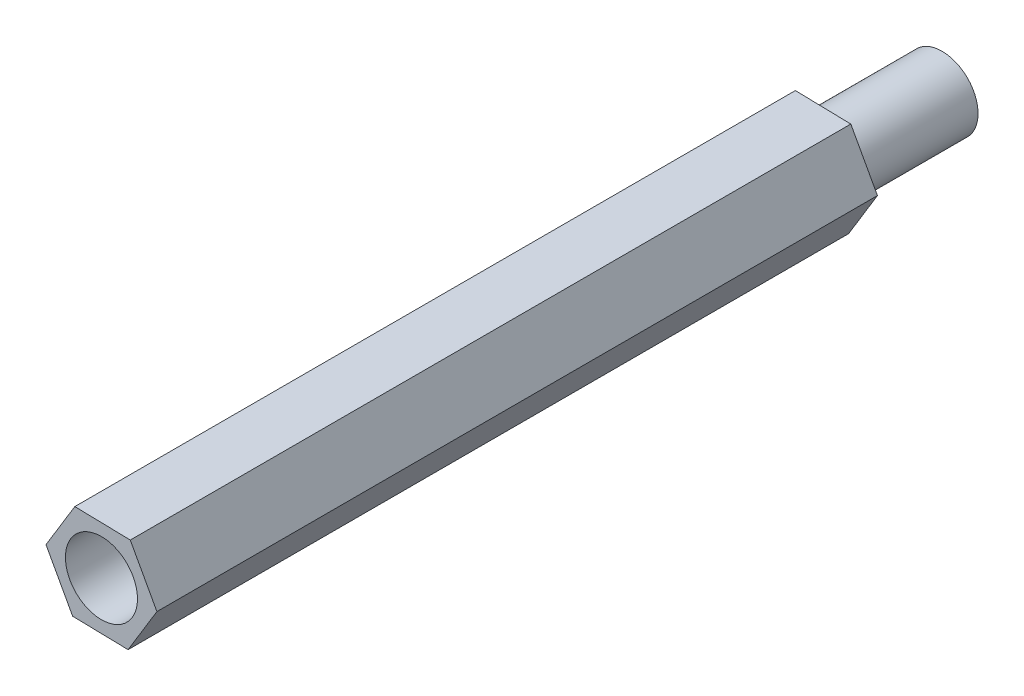
ISO-10303-21;
HEADER;
FILE_DESCRIPTION(('STEP AP214'),'2;1');
FILE_NAME('part.step','',(''),(''),'','','');
FILE_SCHEMA(('AUTOMOTIVE_DESIGN { 1 0 10303 214 1 1 1 1 }'));
ENDSEC;
DATA;
#1=APPLICATION_CONTEXT('core data for automotive mechanical design processes');
#2=APPLICATION_PROTOCOL_DEFINITION('international standard','automotive_design',2000,#1);
#3=PRODUCT_CONTEXT('',#1,'mechanical');
#4=PRODUCT('Part','Part','',(#3));
#5=PRODUCT_RELATED_PRODUCT_CATEGORY('part','',(#4));
#6=PRODUCT_DEFINITION_FORMATION('','',#4);
#7=PRODUCT_DEFINITION_CONTEXT('part definition',#1,'design');
#8=PRODUCT_DEFINITION('design','',#6,#7);
#9=PRODUCT_DEFINITION_SHAPE('','',#8);
#10=(LENGTH_UNIT() NAMED_UNIT(*) SI_UNIT(.MILLI.,.METRE.));
#11=(NAMED_UNIT(*) PLANE_ANGLE_UNIT() SI_UNIT($,.RADIAN.));
#12=(NAMED_UNIT(*) SI_UNIT($,.STERADIAN.) SOLID_ANGLE_UNIT());
#13=UNCERTAINTY_MEASURE_WITH_UNIT(LENGTH_MEASURE(1.E-05),#10,'distance_accuracy_value','');
#14=(GEOMETRIC_REPRESENTATION_CONTEXT(3) GLOBAL_UNCERTAINTY_ASSIGNED_CONTEXT((#13)) GLOBAL_UNIT_ASSIGNED_CONTEXT((#10,
#11,#12)) REPRESENTATION_CONTEXT('',''));
#15=CARTESIAN_POINT('',(0.,0.,0.));
#16=DIRECTION('',(0.,0.,1.));
#17=DIRECTION('',(1.,0.,0.));
#18=AXIS2_PLACEMENT_3D('',#15,#16,#17);
#19=CARTESIAN_POINT('',(-1.19995348671324,-1.97318143186532,30.));
#20=DIRECTION('',(0.0227762459496867,0.999740587662839,0.));
#21=DIRECTION('',(-0.999740587662839,0.0227762459496867,0.));
#22=AXIS2_PLACEMENT_3D('',#19,#20,#21);
#23=PLANE('',#22);
#24=DIRECTION('',(0.999740587662839,-0.0227762459496867,0.));
#25=VECTOR('',#24,1.);
#26=CARTESIAN_POINT('',(-1.19995348671324,-1.97318143186532,0.));
#27=LINE('',#26,#25);
#28=CARTESIAN_POINT('',(-1.19995348671324,-1.97318143186532,0.));
#29=VERTEX_POINT('',#28);
#30=CARTESIAN_POINT('',(1.1088485029145,-2.02578091878604,0.));
#31=VERTEX_POINT('',#30);
#32=EDGE_CURVE('E134',#29,#31,#27,.T.);
#33=ORIENTED_EDGE('',*,*,#32,.T.);
#34=DIRECTION('',(0.,0.,-1.));
#35=VECTOR('',#34,1.);
#36=CARTESIAN_POINT('',(1.1088485029145,-2.02578091878604,30.));
#37=LINE('',#36,#35);
#38=CARTESIAN_POINT('',(1.1088485029145,-2.02578091878604,30.));
#39=VERTEX_POINT('',#38);
#40=EDGE_CURVE('E46',#39,#31,#37,.T.);
#41=ORIENTED_EDGE('',*,*,#40,.F.);
#42=DIRECTION('',(0.999740587662839,-0.0227762459496867,0.));
#43=VECTOR('',#42,1.);
#44=CARTESIAN_POINT('',(-1.19995348671324,-1.97318143186532,30.));
#45=LINE('',#44,#43);
#46=CARTESIAN_POINT('',(-1.19995348671324,-1.97318143186532,30.));
#47=VERTEX_POINT('',#46);
#48=EDGE_CURVE('E151',#47,#39,#45,.T.);
#49=ORIENTED_EDGE('',*,*,#48,.F.);
#50=DIRECTION('',(0.,0.,-1.));
#51=VECTOR('',#50,1.);
#52=CARTESIAN_POINT('',(-1.19995348671324,-1.97318143186532,30.));
#53=LINE('',#52,#51);
#54=EDGE_CURVE('E130',#47,#29,#53,.T.);
#55=ORIENTED_EDGE('',*,*,#54,.T.);
#56=EDGE_LOOP('',(#33,#41,#49,#55));
#57=FACE_BOUND('',#56,.T.);
#58=ADVANCED_FACE('F43',(#57),#23,.F.);
#59=CARTESIAN_POINT('',(1.1088485029145,-2.02578091878604,30.));
#60=DIRECTION('',(-0.854412623135559,0.519595101426691,0.));
#61=DIRECTION('',(-0.519595101426691,-0.854412623135559,0.));
#62=AXIS2_PLACEMENT_3D('',#59,#60,#61);
#63=PLANE('',#62);
#64=DIRECTION('',(0.519595101426691,0.854412623135559,0.));
#65=VECTOR('',#64,1.);
#66=CARTESIAN_POINT('',(1.1088485029145,-2.02578091878604,0.));
#67=LINE('',#66,#65);
#68=CARTESIAN_POINT('',(2.30880198962774,-0.0525994869207228,0.));
#69=VERTEX_POINT('',#68);
#70=EDGE_CURVE('E138',#31,#69,#67,.T.);
#71=ORIENTED_EDGE('',*,*,#70,.T.);
#72=DIRECTION('',(0.,0.,-1.));
#73=VECTOR('',#72,1.);
#74=CARTESIAN_POINT('',(2.30880198962774,-0.0525994869207228,30.));
#75=LINE('',#74,#73);
#76=CARTESIAN_POINT('',(2.30880198962774,-0.0525994869207228,30.));
#77=VERTEX_POINT('',#76);
#78=EDGE_CURVE('E157',#77,#69,#75,.T.);
#79=ORIENTED_EDGE('',*,*,#78,.F.);
#80=DIRECTION('',(0.519595101426691,0.854412623135559,0.));
#81=VECTOR('',#80,1.);
#82=CARTESIAN_POINT('',(1.1088485029145,-2.02578091878604,30.));
#83=LINE('',#82,#81);
#84=EDGE_CURVE('E99',#39,#77,#83,.T.);
#85=ORIENTED_EDGE('',*,*,#84,.F.);
#86=ORIENTED_EDGE('',*,*,#40,.T.);
#87=EDGE_LOOP('',(#71,#79,#85,#86));
#88=FACE_BOUND('',#87,.T.);
#89=ADVANCED_FACE('F164',(#88),#63,.F.);
#90=CARTESIAN_POINT('',(2.30880198962774,-0.0525994869207228,30.));
#91=DIRECTION('',(-0.877188869085246,-0.480145486236149,0.));
#92=DIRECTION('',(0.480145486236149,-0.877188869085246,0.));
#93=AXIS2_PLACEMENT_3D('',#90,#91,#92);
#94=PLANE('',#93);
#95=DIRECTION('',(-0.480145486236149,0.877188869085246,0.));
#96=VECTOR('',#95,1.);
#97=CARTESIAN_POINT('',(2.30880198962774,-0.0525994869207228,0.));
#98=LINE('',#97,#96);
#99=CARTESIAN_POINT('',(1.19995348671324,1.97318143186532,0.));
#100=VERTEX_POINT('',#99);
#101=EDGE_CURVE('E142',#69,#100,#98,.T.);
#102=ORIENTED_EDGE('',*,*,#101,.T.);
#103=DIRECTION('',(0.,0.,-1.));
#104=VECTOR('',#103,1.);
#105=CARTESIAN_POINT('',(1.19995348671324,1.97318143186532,30.));
#106=LINE('',#105,#104);
#107=CARTESIAN_POINT('',(1.19995348671324,1.97318143186532,30.));
#108=VERTEX_POINT('',#107);
#109=EDGE_CURVE('E123',#108,#100,#106,.T.);
#110=ORIENTED_EDGE('',*,*,#109,.F.);
#111=DIRECTION('',(-0.480145486236149,0.877188869085246,0.));
#112=VECTOR('',#111,1.);
#113=CARTESIAN_POINT('',(2.30880198962774,-0.0525994869207228,30.));
#114=LINE('',#113,#112);
#115=EDGE_CURVE('E112',#77,#108,#114,.T.);
#116=ORIENTED_EDGE('',*,*,#115,.F.);
#117=ORIENTED_EDGE('',*,*,#78,.T.);
#118=EDGE_LOOP('',(#102,#110,#116,#117));
#119=FACE_BOUND('',#118,.T.);
#120=ADVANCED_FACE('F170',(#119),#94,.F.);
#121=CARTESIAN_POINT('',(1.19995348671324,1.97318143186532,30.));
#122=DIRECTION('',(-0.0227762459496867,-0.999740587662839,0.));
#123=DIRECTION('',(0.999740587662839,-0.0227762459496867,0.));
#124=AXIS2_PLACEMENT_3D('',#121,#122,#123);
#125=PLANE('',#124);
#126=DIRECTION('',(-0.999740587662839,0.0227762459496867,0.));
#127=VECTOR('',#126,1.);
#128=CARTESIAN_POINT('',(1.19995348671324,1.97318143186532,0.));
#129=LINE('',#128,#127);
#130=CARTESIAN_POINT('',(-1.1088485029145,2.02578091878604,0.));
#131=VERTEX_POINT('',#130);
#132=EDGE_CURVE('E121',#100,#131,#129,.T.);
#133=ORIENTED_EDGE('',*,*,#132,.T.);
#134=DIRECTION('',(0.,0.,-1.));
#135=VECTOR('',#134,1.);
#136=CARTESIAN_POINT('',(-1.1088485029145,2.02578091878604,30.));
#137=LINE('',#136,#135);
#138=CARTESIAN_POINT('',(-1.1088485029145,2.02578091878604,30.));
#139=VERTEX_POINT('',#138);
#140=EDGE_CURVE('E118',#139,#131,#137,.T.);
#141=ORIENTED_EDGE('',*,*,#140,.F.);
#142=DIRECTION('',(-0.999740587662839,0.0227762459496867,0.));
#143=VECTOR('',#142,1.);
#144=CARTESIAN_POINT('',(1.19995348671324,1.97318143186532,30.));
#145=LINE('',#144,#143);
#146=EDGE_CURVE('E106',#108,#139,#145,.T.);
#147=ORIENTED_EDGE('',*,*,#146,.F.);
#148=ORIENTED_EDGE('',*,*,#109,.T.);
#149=EDGE_LOOP('',(#133,#141,#147,#148));
#150=FACE_BOUND('',#149,.T.);
#151=ADVANCED_FACE('F119',(#150),#125,.F.);
#152=CARTESIAN_POINT('',(-1.1088485029145,2.02578091878604,30.));
#153=DIRECTION('',(0.854412623135559,-0.519595101426691,0.));
#154=DIRECTION('',(0.519595101426691,0.854412623135559,0.));
#155=AXIS2_PLACEMENT_3D('',#152,#153,#154);
#156=PLANE('',#155);
#157=DIRECTION('',(-0.519595101426691,-0.854412623135559,0.));
#158=VECTOR('',#157,1.);
#159=CARTESIAN_POINT('',(-1.1088485029145,2.02578091878604,0.));
#160=LINE('',#159,#158);
#161=CARTESIAN_POINT('',(-2.30880198962774,0.0525994869207229,0.));
#162=VERTEX_POINT('',#161);
#163=EDGE_CURVE('E84',#131,#162,#160,.T.);
#164=ORIENTED_EDGE('',*,*,#163,.T.);
#165=DIRECTION('',(0.,0.,-1.));
#166=VECTOR('',#165,1.);
#167=CARTESIAN_POINT('',(-2.30880198962774,0.0525994869207229,30.));
#168=LINE('',#167,#166);
#169=CARTESIAN_POINT('',(-2.30880198962774,0.0525994869207229,30.));
#170=VERTEX_POINT('',#169);
#171=EDGE_CURVE('E124',#170,#162,#168,.T.);
#172=ORIENTED_EDGE('',*,*,#171,.F.);
#173=DIRECTION('',(-0.519595101426691,-0.854412623135559,0.));
#174=VECTOR('',#173,1.);
#175=CARTESIAN_POINT('',(-1.1088485029145,2.02578091878604,30.));
#176=LINE('',#175,#174);
#177=EDGE_CURVE('E110',#139,#170,#176,.T.);
#178=ORIENTED_EDGE('',*,*,#177,.F.);
#179=ORIENTED_EDGE('',*,*,#140,.T.);
#180=EDGE_LOOP('',(#164,#172,#178,#179));
#181=FACE_BOUND('',#180,.T.);
#182=ADVANCED_FACE('F126',(#181),#156,.F.);
#183=CARTESIAN_POINT('',(-2.30880198962774,0.0525994869207229,30.));
#184=DIRECTION('',(0.877188869085246,0.480145486236149,0.));
#185=DIRECTION('',(-0.480145486236149,0.877188869085246,0.));
#186=AXIS2_PLACEMENT_3D('',#183,#184,#185);
#187=PLANE('',#186);
#188=DIRECTION('',(0.480145486236148,-0.877188869085246,0.));
#189=VECTOR('',#188,1.);
#190=CARTESIAN_POINT('',(-2.30880198962774,0.0525994869207229,0.));
#191=LINE('',#190,#189);
#192=EDGE_CURVE('E90',#162,#29,#191,.T.);
#193=ORIENTED_EDGE('',*,*,#192,.T.);
#194=ORIENTED_EDGE('',*,*,#54,.F.);
#195=DIRECTION('',(0.480145486236148,-0.877188869085246,0.));
#196=VECTOR('',#195,1.);
#197=CARTESIAN_POINT('',(-2.30880198962774,0.0525994869207229,30.));
#198=LINE('',#197,#196);
#199=EDGE_CURVE('E61',#170,#47,#198,.T.);
#200=ORIENTED_EDGE('',*,*,#199,.F.);
#201=ORIENTED_EDGE('',*,*,#171,.T.);
#202=EDGE_LOOP('',(#193,#194,#200,#201));
#203=FACE_BOUND('',#202,.T.);
#204=ADVANCED_FACE('F199',(#203),#187,.F.);
#205=CARTESIAN_POINT('',(0.,0.,30.));
#206=DIRECTION('',(0.,0.,1.));
#207=DIRECTION('',(1.,0.,0.));
#208=AXIS2_PLACEMENT_3D('',#205,#206,#207);
#209=PLANE('',#208);
#210=CARTESIAN_POINT('',(0.,0.,30.));
#211=DIRECTION('',(0.,0.,1.));
#212=DIRECTION('',(1.,0.,0.));
#213=AXIS2_PLACEMENT_3D('',#210,#211,#212);
#214=CIRCLE('',#213,1.5);
#215=CARTESIAN_POINT('',(1.5,0.,30.));
#216=VERTEX_POINT('',#215);
#217=EDGE_CURVE('E181',#216,#216,#214,.T.);
#218=ORIENTED_EDGE('',*,*,#217,.F.);
#219=EDGE_LOOP('',(#218));
#220=FACE_BOUND('',#219,.T.);
#221=ORIENTED_EDGE('',*,*,#48,.T.);
#222=ORIENTED_EDGE('',*,*,#84,.T.);
#223=ORIENTED_EDGE('',*,*,#115,.T.);
#224=ORIENTED_EDGE('',*,*,#146,.T.);
#225=ORIENTED_EDGE('',*,*,#177,.T.);
#226=ORIENTED_EDGE('',*,*,#199,.T.);
#227=EDGE_LOOP('',(#221,#222,#223,#224,#225,#226));
#228=FACE_BOUND('',#227,.T.);
#229=ADVANCED_FACE('F108',(#220,#228),#209,.T.);
#230=CARTESIAN_POINT('',(0.,0.,0.));
#231=DIRECTION('',(0.,0.,1.));
#232=DIRECTION('',(1.,0.,0.));
#233=AXIS2_PLACEMENT_3D('',#230,#231,#232);
#234=PLANE('',#233);
#235=CARTESIAN_POINT('',(0.,0.,0.));
#236=DIRECTION('',(0.,0.,-1.));
#237=DIRECTION('',(-1.,0.,0.));
#238=AXIS2_PLACEMENT_3D('',#235,#236,#237);
#239=CIRCLE('',#238,1.49835435215941);
#240=CARTESIAN_POINT('',(-1.49835435215941,0.,0.));
#241=VERTEX_POINT('',#240);
#242=EDGE_CURVE('E11',#241,#241,#239,.T.);
#243=ORIENTED_EDGE('',*,*,#242,.F.);
#244=EDGE_LOOP('',(#243));
#245=FACE_BOUND('',#244,.T.);
#246=ORIENTED_EDGE('',*,*,#32,.F.);
#247=ORIENTED_EDGE('',*,*,#192,.F.);
#248=ORIENTED_EDGE('',*,*,#163,.F.);
#249=ORIENTED_EDGE('',*,*,#132,.F.);
#250=ORIENTED_EDGE('',*,*,#101,.F.);
#251=ORIENTED_EDGE('',*,*,#70,.F.);
#252=EDGE_LOOP('',(#246,#247,#248,#249,#250,#251));
#253=FACE_BOUND('',#252,.T.);
#254=ADVANCED_FACE('F169',(#245,#253),#234,.F.);
#255=CARTESIAN_POINT('',(0.,0.,-5.));
#256=DIRECTION('',(0.,0.,1.));
#257=DIRECTION('',(1.,0.,0.));
#258=AXIS2_PLACEMENT_3D('',#255,#256,#257);
#259=CYLINDRICAL_SURFACE('',#258,1.49835435215941);
#260=CARTESIAN_POINT('',(0.,0.,-5.));
#261=DIRECTION('',(0.,0.,-1.));
#262=DIRECTION('',(-1.,0.,0.));
#263=AXIS2_PLACEMENT_3D('',#260,#261,#262);
#264=CIRCLE('',#263,1.49835435215941);
#265=CARTESIAN_POINT('',(-1.49835435215941,0.,-5.));
#266=VERTEX_POINT('',#265);
#267=EDGE_CURVE('E139',#266,#266,#264,.T.);
#268=ORIENTED_EDGE('',*,*,#267,.F.);
#269=EDGE_LOOP('',(#268));
#270=FACE_BOUND('',#269,.T.);
#271=ORIENTED_EDGE('',*,*,#242,.T.);
#272=EDGE_LOOP('',(#271));
#273=FACE_BOUND('',#272,.T.);
#274=ADVANCED_FACE('F205',(#270,#273),#259,.T.);
#275=CARTESIAN_POINT('',(0.,0.,-5.));
#276=DIRECTION('',(0.,0.,-1.));
#277=DIRECTION('',(-1.,0.,0.));
#278=AXIS2_PLACEMENT_3D('',#275,#276,#277);
#279=PLANE('',#278);
#280=ORIENTED_EDGE('',*,*,#267,.T.);
#281=EDGE_LOOP('',(#280));
#282=FACE_BOUND('',#281,.T.);
#283=ADVANCED_FACE('F194',(#282),#279,.T.);
#284=CARTESIAN_POINT('',(0.,0.,25.));
#285=DIRECTION('',(0.,0.,1.));
#286=DIRECTION('',(1.,0.,0.));
#287=AXIS2_PLACEMENT_3D('',#284,#285,#286);
#288=CYLINDRICAL_SURFACE('',#287,1.5);
#289=CARTESIAN_POINT('',(0.,0.,25.));
#290=DIRECTION('',(0.,0.,1.));
#291=DIRECTION('',(1.,0.,0.));
#292=AXIS2_PLACEMENT_3D('',#289,#290,#291);
#293=CIRCLE('',#292,1.5);
#294=CARTESIAN_POINT('',(1.5,0.,25.));
#295=VERTEX_POINT('',#294);
#296=EDGE_CURVE('E180',#295,#295,#293,.T.);
#297=ORIENTED_EDGE('',*,*,#296,.F.);
#298=EDGE_LOOP('',(#297));
#299=FACE_BOUND('',#298,.T.);
#300=ORIENTED_EDGE('',*,*,#217,.T.);
#301=EDGE_LOOP('',(#300));
#302=FACE_BOUND('',#301,.T.);
#303=ADVANCED_FACE('F191',(#299,#302),#288,.F.);
#304=CARTESIAN_POINT('',(0.,0.,25.));
#305=DIRECTION('',(0.,0.,1.));
#306=DIRECTION('',(1.,0.,0.));
#307=AXIS2_PLACEMENT_3D('',#304,#305,#306);
#308=PLANE('',#307);
#309=ORIENTED_EDGE('',*,*,#296,.T.);
#310=EDGE_LOOP('',(#309));
#311=FACE_BOUND('',#310,.T.);
#312=ADVANCED_FACE('F189',(#311),#308,.T.);
#313=CLOSED_SHELL('',(#58,#89,#120,#151,#182,#204,#229,#254,#274,#283,#303,#312));
#314=MANIFOLD_SOLID_BREP('B2',#313);
#315=ADVANCED_BREP_SHAPE_REPRESENTATION('',(#18,#314),#14);
#316=SHAPE_DEFINITION_REPRESENTATION(#9,#315);
ENDSEC;
END-ISO-10303-21;
